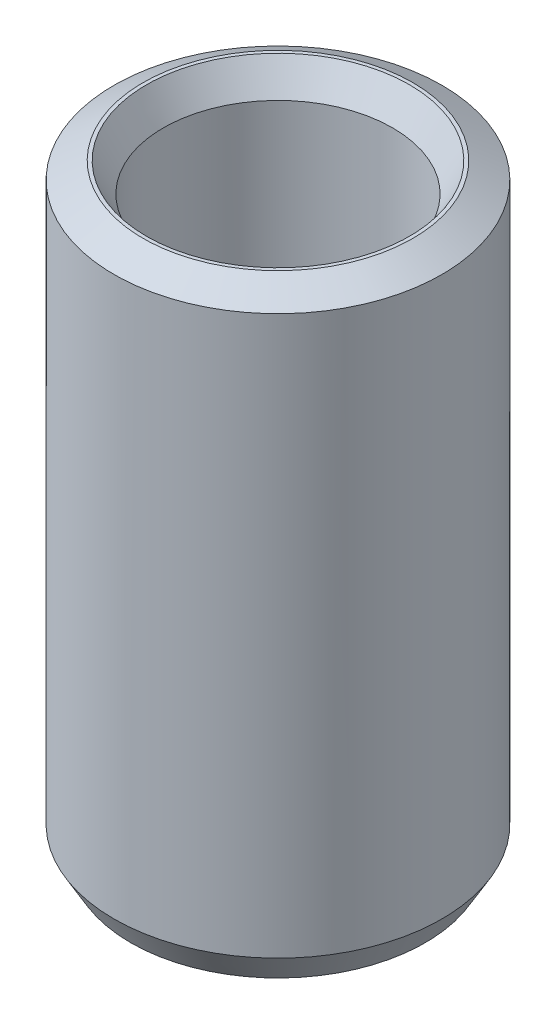
ISO-10303-21;
HEADER;
FILE_DESCRIPTION(('STEP AP214'),'2;1');
FILE_NAME('part.step','',(''),(''),'','','');
FILE_SCHEMA(('AUTOMOTIVE_DESIGN { 1 0 10303 214 1 1 1 1 }'));
ENDSEC;
DATA;
#1=APPLICATION_CONTEXT('core data for automotive mechanical design processes');
#2=APPLICATION_PROTOCOL_DEFINITION('international standard','automotive_design',2000,#1);
#3=PRODUCT_CONTEXT('',#1,'mechanical');
#4=PRODUCT('Part','Part','',(#3));
#5=PRODUCT_RELATED_PRODUCT_CATEGORY('part','',(#4));
#6=PRODUCT_DEFINITION_FORMATION('','',#4);
#7=PRODUCT_DEFINITION_CONTEXT('part definition',#1,'design');
#8=PRODUCT_DEFINITION('design','',#6,#7);
#9=PRODUCT_DEFINITION_SHAPE('','',#8);
#10=(LENGTH_UNIT() NAMED_UNIT(*) SI_UNIT(.MILLI.,.METRE.));
#11=(NAMED_UNIT(*) PLANE_ANGLE_UNIT() SI_UNIT($,.RADIAN.));
#12=(NAMED_UNIT(*) SI_UNIT($,.STERADIAN.) SOLID_ANGLE_UNIT());
#13=UNCERTAINTY_MEASURE_WITH_UNIT(LENGTH_MEASURE(1.E-05),#10,'distance_accuracy_value','');
#14=(GEOMETRIC_REPRESENTATION_CONTEXT(3) GLOBAL_UNCERTAINTY_ASSIGNED_CONTEXT((#13)) GLOBAL_UNIT_ASSIGNED_CONTEXT((#10,
#11,#12)) REPRESENTATION_CONTEXT('',''));
#15=CARTESIAN_POINT('',(0.,0.,0.));
#16=DIRECTION('',(0.,0.,1.));
#17=DIRECTION('',(1.,0.,0.));
#18=AXIS2_PLACEMENT_3D('',#15,#16,#17);
#19=CARTESIAN_POINT('',(0.,110.504376161559,0.));
#20=DIRECTION('',(0.,-1.,0.));
#21=DIRECTION('',(0.,0.,-1.));
#22=AXIS2_PLACEMENT_3D('',#19,#20,#21);
#23=CYLINDRICAL_SURFACE('',#22,30.);
#24=CARTESIAN_POINT('',(0.,5.31062044383036,0.));
#25=DIRECTION('',(0.,1.,0.));
#26=DIRECTION('',(0.,0.,1.));
#27=AXIS2_PLACEMENT_3D('',#24,#25,#26);
#28=CIRCLE('',#27,30.);
#29=CARTESIAN_POINT('',(0.,5.31062044383036,30.));
#30=VERTEX_POINT('',#29);
#31=EDGE_CURVE('E10',#30,#30,#28,.T.);
#32=ORIENTED_EDGE('',*,*,#31,.T.);
#33=EDGE_LOOP('',(#32));
#34=FACE_BOUND('',#33,.T.);
#35=CARTESIAN_POINT('',(0.,107.438288018749,0.));
#36=DIRECTION('',(0.,1.,0.));
#37=DIRECTION('',(0.,0.,1.));
#38=AXIS2_PLACEMENT_3D('',#35,#36,#37);
#39=CIRCLE('',#38,30.);
#40=CARTESIAN_POINT('',(0.,107.438288018749,-30.));
#41=VERTEX_POINT('',#40);
#42=EDGE_CURVE('E50',#41,#41,#39,.F.);
#43=ORIENTED_EDGE('',*,*,#42,.T.);
#44=EDGE_LOOP('',(#43));
#45=FACE_BOUND('',#44,.T.);
#46=ADVANCED_FACE('F39',(#34,#45),#23,.T.);
#47=CARTESIAN_POINT('',(0.,110.504376161559,0.));
#48=DIRECTION('',(0.,1.,0.));
#49=DIRECTION('',(0.,0.,1.));
#50=AXIS2_PLACEMENT_3D('',#47,#48,#49);
#51=PLANE('',#50);
#52=CARTESIAN_POINT('',(0.,110.504376161559,0.));
#53=DIRECTION('',(0.,1.,0.));
#54=DIRECTION('',(0.,0.,1.));
#55=AXIS2_PLACEMENT_3D('',#52,#53,#54);
#56=CIRCLE('',#55,24.0467735924519);
#57=CARTESIAN_POINT('',(0.,110.504376161559,24.0467735924519));
#58=VERTEX_POINT('',#57);
#59=EDGE_CURVE('E58',#58,#58,#56,.F.);
#60=ORIENTED_EDGE('',*,*,#59,.T.);
#61=EDGE_LOOP('',(#60));
#62=FACE_BOUND('',#61,.T.);
#63=CARTESIAN_POINT('',(0.,110.504376161559,0.));
#64=DIRECTION('',(0.,1.,0.));
#65=DIRECTION('',(0.,0.,1.));
#66=AXIS2_PLACEMENT_3D('',#63,#64,#65);
#67=CIRCLE('',#66,24.6893795561696);
#68=CARTESIAN_POINT('',(0.,110.504376161559,-24.6893795561697));
#69=VERTEX_POINT('',#68);
#70=EDGE_CURVE('E61',#69,#69,#67,.T.);
#71=ORIENTED_EDGE('',*,*,#70,.T.);
#72=EDGE_LOOP('',(#71));
#73=FACE_BOUND('',#72,.T.);
#74=ADVANCED_FACE('F88',(#62,#73),#51,.T.);
#75=CARTESIAN_POINT('',(0.,0.,0.));
#76=DIRECTION('',(0.,1.,0.));
#77=DIRECTION('',(0.,0.,1.));
#78=AXIS2_PLACEMENT_3D('',#75,#76,#77);
#79=PLANE('',#78);
#80=CARTESIAN_POINT('',(0.,0.,0.));
#81=DIRECTION('',(0.,1.,0.));
#82=DIRECTION('',(0.,0.,1.));
#83=AXIS2_PLACEMENT_3D('',#80,#81,#82);
#84=CIRCLE('',#83,26.2913058934728);
#85=CARTESIAN_POINT('',(0.,0.,-26.2913058934728));
#86=VERTEX_POINT('',#85);
#87=EDGE_CURVE('E51',#86,#86,#84,.T.);
#88=ORIENTED_EDGE('',*,*,#87,.T.);
#89=EDGE_LOOP('',(#88));
#90=FACE_BOUND('',#89,.T.);
#91=CARTESIAN_POINT('',(0.,0.,0.));
#92=DIRECTION('',(0.,1.,0.));
#93=DIRECTION('',(0.,0.,1.));
#94=AXIS2_PLACEMENT_3D('',#91,#92,#93);
#95=CIRCLE('',#94,26.9339118571906);
#96=CARTESIAN_POINT('',(0.,0.,26.9339118571906));
#97=VERTEX_POINT('',#96);
#98=EDGE_CURVE('E54',#97,#97,#95,.F.);
#99=ORIENTED_EDGE('',*,*,#98,.T.);
#100=EDGE_LOOP('',(#99));
#101=FACE_BOUND('',#100,.T.);
#102=ADVANCED_FACE('F83',(#90,#101),#79,.F.);
#103=CARTESIAN_POINT('',(0.,110.504376161559,0.));
#104=DIRECTION('',(0.,-1.,0.));
#105=DIRECTION('',(0.,0.,-1.));
#106=AXIS2_PLACEMENT_3D('',#103,#104,#105);
#107=CYLINDRICAL_SURFACE('',#106,20.9806854496425);
#108=CARTESIAN_POINT('',(0.,105.193755717728,0.));
#109=DIRECTION('',(0.,1.,0.));
#110=DIRECTION('',(0.,0.,1.));
#111=AXIS2_PLACEMENT_3D('',#108,#109,#110);
#112=CIRCLE('',#111,20.9806854496425);
#113=CARTESIAN_POINT('',(0.,105.193755717728,20.9806854496425));
#114=VERTEX_POINT('',#113);
#115=EDGE_CURVE('E67',#114,#114,#112,.T.);
#116=ORIENTED_EDGE('',*,*,#115,.T.);
#117=EDGE_LOOP('',(#116));
#118=FACE_BOUND('',#117,.T.);
#119=CARTESIAN_POINT('',(0.,3.0660881428094,0.));
#120=DIRECTION('',(0.,1.,0.));
#121=DIRECTION('',(0.,0.,1.));
#122=AXIS2_PLACEMENT_3D('',#119,#120,#121);
#123=CIRCLE('',#122,20.9806854496425);
#124=CARTESIAN_POINT('',(0.,3.0660881428094,-20.9806854496425));
#125=VERTEX_POINT('',#124);
#126=EDGE_CURVE('E69',#125,#125,#123,.F.);
#127=ORIENTED_EDGE('',*,*,#126,.T.);
#128=EDGE_LOOP('',(#127));
#129=FACE_BOUND('',#128,.T.);
#130=ADVANCED_FACE('F71',(#118,#129),#107,.F.);
#131=CARTESIAN_POINT('',(0.,105.193755717728,0.));
#132=DIRECTION('',(0.,1.,0.));
#133=DIRECTION('',(0.,0.,1.));
#134=AXIS2_PLACEMENT_3D('',#131,#132,#133);
#135=CONICAL_SURFACE('',#134,20.9806854496425,0.523598775598303);
#136=ORIENTED_EDGE('',*,*,#59,.F.);
#137=EDGE_LOOP('',(#136));
#138=FACE_BOUND('',#137,.T.);
#139=ORIENTED_EDGE('',*,*,#115,.F.);
#140=EDGE_LOOP('',(#139));
#141=FACE_BOUND('',#140,.T.);
#142=ADVANCED_FACE('F77',(#138,#141),#135,.F.);
#143=CARTESIAN_POINT('',(0.,0.,0.));
#144=DIRECTION('',(0.,-1.,0.));
#145=DIRECTION('',(0.,0.,-1.));
#146=AXIS2_PLACEMENT_3D('',#143,#144,#145);
#147=CONICAL_SURFACE('',#146,26.2913058934728,1.0471975511966);
#148=CARTESIAN_POINT('',(0.,3.0660881428094,-20.9806854496425));
#149=CARTESIAN_POINT('',(0.,3.03414972465513,-21.036004412599));
#150=CARTESIAN_POINT('',(0.,3.00221130650087,-21.0913233755556));
#151=CARTESIAN_POINT('',(0.,2.93833447019234,-21.2019613014687));
#152=CARTESIAN_POINT('',(0.,2.90639605203807,-21.2572802644253));
#153=CARTESIAN_POINT('',(0.,2.84251921572955,-21.3679181903384));
#154=CARTESIAN_POINT('',(0.,2.81058079757528,-21.423237153295));
#155=CARTESIAN_POINT('',(0.,2.74670396126675,-21.5338750792081));
#156=CARTESIAN_POINT('',(0.,2.71476554311249,-21.5891940421647));
#157=CARTESIAN_POINT('',(0.,2.65088870680396,-21.6998319680778));
#158=CARTESIAN_POINT('',(0.,2.61895028864969,-21.7551509310344));
#159=CARTESIAN_POINT('',(0.,2.55507345234116,-21.8657888569475));
#160=CARTESIAN_POINT('',(0.,2.5231350341869,-21.9211078199041));
#161=CARTESIAN_POINT('',(0.,2.45925819787837,-22.0317457458172));
#162=CARTESIAN_POINT('',(0.,2.42731977972411,-22.0870647087738));
#163=CARTESIAN_POINT('',(0.,2.36344294341558,-22.1977026346869));
#164=CARTESIAN_POINT('',(0.,2.33150452526131,-22.2530215976435));
#165=CARTESIAN_POINT('',(0.,2.26762768895278,-22.3636595235566));
#166=CARTESIAN_POINT('',(0.,2.23568927079852,-22.4189784865132));
#167=CARTESIAN_POINT('',(0.,2.17181243448999,-22.5296164124263));
#168=CARTESIAN_POINT('',(0.,2.13987401633573,-22.5849353753829));
#169=CARTESIAN_POINT('',(0.,2.0759971800272,-22.695573301296));
#170=CARTESIAN_POINT('',(0.,2.04405876187293,-22.7508922642526));
#171=CARTESIAN_POINT('',(0.,1.9801819255644,-22.8615301901657));
#172=CARTESIAN_POINT('',(0.,1.94824350741014,-22.9168491531223));
#173=CARTESIAN_POINT('',(0.,1.88436667110161,-23.0274870790354));
#174=CARTESIAN_POINT('',(0.,1.85242825294734,-23.082806041992));
#175=CARTESIAN_POINT('',(0.,1.78855141663882,-23.1934439679051));
#176=CARTESIAN_POINT('',(0.,1.75661299848455,-23.2487629308617));
#177=CARTESIAN_POINT('',(0.,1.69273616217602,-23.3594008567748));
#178=CARTESIAN_POINT('',(0.,1.66079774402176,-23.4147198197314));
#179=CARTESIAN_POINT('',(0.,1.59692090771323,-23.5253577456445));
#180=CARTESIAN_POINT('',(0.,1.56498248955896,-23.5806767086011));
#181=CARTESIAN_POINT('',(0.,1.50110565325043,-23.6913146345142));
#182=CARTESIAN_POINT('',(0.,1.46916723509617,-23.7466335974708));
#183=CARTESIAN_POINT('',(0.,1.40529039878764,-23.8572715233839));
#184=CARTESIAN_POINT('',(0.,1.37335198063338,-23.9125904863405));
#185=CARTESIAN_POINT('',(0.,1.30947514432485,-24.0232284122536));
#186=CARTESIAN_POINT('',(0.,1.27753672617058,-24.0785473752102));
#187=CARTESIAN_POINT('',(0.,1.21365988986205,-24.1891853011233));
#188=CARTESIAN_POINT('',(0.,1.18172147170779,-24.2445042640799));
#189=CARTESIAN_POINT('',(0.,1.11784463539926,-24.355142189993));
#190=CARTESIAN_POINT('',(0.,1.08590621724499,-24.4104611529496));
#191=CARTESIAN_POINT('',(0.,1.02202938093647,-24.5210990788627));
#192=CARTESIAN_POINT('',(0.,0.990090962782201,-24.5764180418193));
#193=CARTESIAN_POINT('',(0.,0.926214126473672,-24.6870559677324));
#194=CARTESIAN_POINT('',(0.,0.894275708319407,-24.742374930689));
#195=CARTESIAN_POINT('',(0.,0.830398872010878,-24.8530128566021));
#196=CARTESIAN_POINT('',(0.,0.798460453856614,-24.9083318195587));
#197=CARTESIAN_POINT('',(0.,0.734583617548085,-25.0189697454718));
#198=CARTESIAN_POINT('',(0.,0.70264519939382,-25.0742887084284));
#199=CARTESIAN_POINT('',(0.,0.638768363085291,-25.1849266343415));
#200=CARTESIAN_POINT('',(0.,0.606829944931026,-25.2402455972981));
#201=CARTESIAN_POINT('',(0.,0.542953108622497,-25.3508835232112));
#202=CARTESIAN_POINT('',(0.,0.511014690468233,-25.4062024861678));
#203=CARTESIAN_POINT('',(0.,0.447137854159704,-25.5168404120809));
#204=CARTESIAN_POINT('',(0.,0.415199436005439,-25.5721593750375));
#205=CARTESIAN_POINT('',(0.,0.35132259969691,-25.6827973009506));
#206=CARTESIAN_POINT('',(0.,0.319384181542646,-25.7381162639072));
#207=CARTESIAN_POINT('',(0.,0.255507345234116,-25.8487541898203));
#208=CARTESIAN_POINT('',(0.,0.223568927079852,-25.9040731527769));
#209=CARTESIAN_POINT('',(0.,0.159692090771323,-26.01471107869));
#210=CARTESIAN_POINT('',(0.,0.127753672617058,-26.0700300416466));
#211=CARTESIAN_POINT('',(0.,0.0638768363085291,-26.1806679675597));
#212=CARTESIAN_POINT('',(0.,0.0319384181542646,-26.2359869305163));
#213=CARTESIAN_POINT('',(0.,0.,-26.2913058934728));
#214=B_SPLINE_CURVE_WITH_KNOTS('',3,(#148,#149,#150,#151,#152,#153,#154,#155,#156,#157,#158,
#159,#160,#161,#162,#163,#164,#165,#166,#167,#168,#169,#170,#171,#172,#173,#174,#175,#176,#177,
#178,#179,#180,#181,#182,#183,#184,#185,#186,#187,#188,#189,#190,#191,#192,#193,#194,#195,#196,
#197,#198,#199,#200,#201,#202,#203,#204,#205,#206,#207,#208,#209,#210,#211,#212,#213),
.UNSPECIFIED.,.F.,.F.,(4,2,2,2,2,2,2,2,2,2,2,2,2,2,2,2,2,2,2,2,2,2,2,2,2,2,2,2,2,2,2,2,4),(0.,
0.191630508925587,0.383261017851173,0.57489152677676,0.766522035702347,0.958152544627933,
1.14978305355352,1.34141356247911,1.53304407140469,1.72467458033028,1.91630508925587,
2.10793559818146,2.29956610710704,2.49119661603263,2.68282712495822,2.8744576338838,
3.06608814280939,3.25771865173497,3.44934916066056,3.64097966958615,3.83261017851173,
4.02424068743732,4.21587119636291,4.40750170528849,4.59913221421408,4.79076272313967,
4.98239323206526,5.17402374099084,5.36565424991643,5.55728475884202,5.7489152677676,
5.94054577669319,6.13217628561878),.UNSPECIFIED.);
#215=EDGE_CURVE('BSEAM73',#125,#86,#214,.T.);
#216=ORIENTED_EDGE('',*,*,#126,.F.);
#217=ORIENTED_EDGE('',*,*,#87,.F.);
#218=ORIENTED_EDGE('',*,*,#215,.T.);
#219=ORIENTED_EDGE('',*,*,#215,.F.);
#220=EDGE_LOOP('',(#216,#218,#217,#219));
#221=FACE_BOUND('',#220,.T.);
#222=ADVANCED_FACE('F73',(#221),#147,.F.);
#223=CARTESIAN_POINT('',(0.,5.31062044383036,0.));
#224=DIRECTION('',(0.,1.,0.));
#225=DIRECTION('',(0.,0.,1.));
#226=AXIS2_PLACEMENT_3D('',#223,#224,#225);
#227=CONICAL_SURFACE('',#226,30.,0.523598775598303);
#228=ORIENTED_EDGE('',*,*,#98,.F.);
#229=EDGE_LOOP('',(#228));
#230=FACE_BOUND('',#229,.T.);
#231=ORIENTED_EDGE('',*,*,#31,.F.);
#232=EDGE_LOOP('',(#231));
#233=FACE_BOUND('',#232,.T.);
#234=ADVANCED_FACE('F76',(#230,#233),#227,.T.);
#235=CARTESIAN_POINT('',(0.,110.504376161559,0.));
#236=DIRECTION('',(0.,-1.,0.));
#237=DIRECTION('',(0.,0.,-1.));
#238=AXIS2_PLACEMENT_3D('',#235,#236,#237);
#239=CONICAL_SURFACE('',#238,24.6893795561696,1.0471975511966);
#240=CARTESIAN_POINT('',(0.,107.438288018749,-30.));
#241=CARTESIAN_POINT('',(0.,107.470226436904,-29.9446810370434));
#242=CARTESIAN_POINT('',(0.,107.502164855058,-29.8893620740869));
#243=CARTESIAN_POINT('',(0.,107.566041691366,-29.7787241481737));
#244=CARTESIAN_POINT('',(0.,107.597980109521,-29.7234051852172));
#245=CARTESIAN_POINT('',(0.,107.661856945829,-29.6127672593041));
#246=CARTESIAN_POINT('',(0.,107.693795363983,-29.5574482963475));
#247=CARTESIAN_POINT('',(0.,107.757672200292,-29.4468103704343));
#248=CARTESIAN_POINT('',(0.,107.789610618446,-29.3914914074778));
#249=CARTESIAN_POINT('',(0.,107.853487454755,-29.2808534815647));
#250=CARTESIAN_POINT('',(0.,107.885425872909,-29.2255345186081));
#251=CARTESIAN_POINT('',(0.,107.949302709218,-29.114896592695));
#252=CARTESIAN_POINT('',(0.,107.981241127372,-29.0595776297384));
#253=CARTESIAN_POINT('',(0.,108.04511796368,-28.9489397038253));
#254=CARTESIAN_POINT('',(0.,108.077056381835,-28.8936207408687));
#255=CARTESIAN_POINT('',(0.,108.140933218143,-28.7829828149556));
#256=CARTESIAN_POINT('',(0.,108.172871636297,-28.727663851999));
#257=CARTESIAN_POINT('',(0.,108.236748472606,-28.6170259260859));
#258=CARTESIAN_POINT('',(0.,108.26868689076,-28.5617069631293));
#259=CARTESIAN_POINT('',(0.,108.332563727069,-28.4510690372162));
#260=CARTESIAN_POINT('',(0.,108.364502145223,-28.3957500742596));
#261=CARTESIAN_POINT('',(0.,108.428378981532,-28.2851121483465));
#262=CARTESIAN_POINT('',(0.,108.460317399686,-28.2297931853899));
#263=CARTESIAN_POINT('',(0.,108.524194235994,-28.1191552594768));
#264=CARTESIAN_POINT('',(0.,108.556132654149,-28.0638362965202));
#265=CARTESIAN_POINT('',(0.,108.620009490457,-27.9531983706071));
#266=CARTESIAN_POINT('',(0.,108.651947908611,-27.8978794076505));
#267=CARTESIAN_POINT('',(0.,108.71582474492,-27.7872414817374));
#268=CARTESIAN_POINT('',(0.,108.747763163074,-27.7319225187808));
#269=CARTESIAN_POINT('',(0.,108.811639999383,-27.6212845928677));
#270=CARTESIAN_POINT('',(0.,108.843578417537,-27.5659656299111));
#271=CARTESIAN_POINT('',(0.,108.907455253846,-27.455327703998));
#272=CARTESIAN_POINT('',(0.,108.939393672,-27.4000087410414));
#273=CARTESIAN_POINT('',(0.,109.003270508308,-27.2893708151283));
#274=CARTESIAN_POINT('',(0.,109.035208926463,-27.2340518521717));
#275=CARTESIAN_POINT('',(0.,109.099085762771,-27.1234139262586));
#276=CARTESIAN_POINT('',(0.,109.131024180925,-27.068094963302));
#277=CARTESIAN_POINT('',(0.,109.194901017234,-26.9574570373889));
#278=CARTESIAN_POINT('',(0.,109.226839435388,-26.9021380744323));
#279=CARTESIAN_POINT('',(0.,109.290716271697,-26.7915001485192));
#280=CARTESIAN_POINT('',(0.,109.322654689851,-26.7361811855626));
#281=CARTESIAN_POINT('',(0.,109.386531526159,-26.6255432596495));
#282=CARTESIAN_POINT('',(0.,109.418469944314,-26.5702242966929));
#283=CARTESIAN_POINT('',(0.,109.482346780622,-26.4595863707798));
#284=CARTESIAN_POINT('',(0.,109.514285198777,-26.4042674078232));
#285=CARTESIAN_POINT('',(0.,109.578162035085,-26.2936294819101));
#286=CARTESIAN_POINT('',(0.,109.610100453239,-26.2383105189535));
#287=CARTESIAN_POINT('',(0.,109.673977289548,-26.1276725930404));
#288=CARTESIAN_POINT('',(0.,109.705915707702,-26.0723536300838));
#289=CARTESIAN_POINT('',(0.,109.769792544011,-25.9617157041707));
#290=CARTESIAN_POINT('',(0.,109.801730962165,-25.9063967412141));
#291=CARTESIAN_POINT('',(0.,109.865607798473,-25.795758815301));
#292=CARTESIAN_POINT('',(0.,109.897546216628,-25.7404398523444));
#293=CARTESIAN_POINT('',(0.,109.961423052936,-25.6298019264313));
#294=CARTESIAN_POINT('',(0.,109.99336147109,-25.5744829634747));
#295=CARTESIAN_POINT('',(0.,110.057238307399,-25.4638450375616));
#296=CARTESIAN_POINT('',(0.,110.089176725553,-25.408526074605));
#297=CARTESIAN_POINT('',(0.,110.153053561862,-25.2978881486919));
#298=CARTESIAN_POINT('',(0.,110.184991980016,-25.2425691857353));
#299=CARTESIAN_POINT('',(0.,110.248868816325,-25.1319312598222));
#300=CARTESIAN_POINT('',(0.,110.280807234479,-25.0766122968656));
#301=CARTESIAN_POINT('',(0.,110.344684070787,-24.9659743709525));
#302=CARTESIAN_POINT('',(0.,110.376622488942,-24.9106554079959));
#303=CARTESIAN_POINT('',(0.,110.44049932525,-24.8000174820828));
#304=CARTESIAN_POINT('',(0.,110.472437743404,-24.7446985191262));
#305=CARTESIAN_POINT('',(0.,110.504376161559,-24.6893795561697));
#306=B_SPLINE_CURVE_WITH_KNOTS('',3,(#240,#241,#242,#243,#244,#245,#246,#247,#248,#249,#250,
#251,#252,#253,#254,#255,#256,#257,#258,#259,#260,#261,#262,#263,#264,#265,#266,#267,#268,#269,
#270,#271,#272,#273,#274,#275,#276,#277,#278,#279,#280,#281,#282,#283,#284,#285,#286,#287,#288,
#289,#290,#291,#292,#293,#294,#295,#296,#297,#298,#299,#300,#301,#302,#303,#304,#305),
.UNSPECIFIED.,.F.,.F.,(4,2,2,2,2,2,2,2,2,2,2,2,2,2,2,2,2,2,2,2,2,2,2,2,2,2,2,2,2,2,2,2,4),(0.,
0.191630508925584,0.38326101785117,0.574891526776761,0.766522035702347,0.958152544627931,
1.14978305355352,1.34141356247911,1.53304407140469,1.72467458033028,1.91630508925586,
2.10793559818145,2.29956610710704,2.49119661603262,2.68282712495821,2.8744576338838,
3.06608814280939,3.25771865173497,3.44934916066056,3.64097966958615,3.83261017851173,
4.02424068743732,4.2158711963629,4.40750170528849,4.59913221421408,4.79076272313966,
4.98239323206525,5.17402374099084,5.36565424991643,5.55728475884201,5.7489152677676,
5.94054577669319,6.13217628561878),.UNSPECIFIED.);
#307=EDGE_CURVE('BSEAM45',#41,#69,#306,.T.);
#308=ORIENTED_EDGE('',*,*,#42,.F.);
#309=ORIENTED_EDGE('',*,*,#70,.F.);
#310=ORIENTED_EDGE('',*,*,#307,.T.);
#311=ORIENTED_EDGE('',*,*,#307,.F.);
#312=EDGE_LOOP('',(#308,#310,#309,#311));
#313=FACE_BOUND('',#312,.T.);
#314=ADVANCED_FACE('F45',(#313),#239,.T.);
#315=CLOSED_SHELL('',(#46,#74,#102,#130,#142,#222,#234,#314));
#316=MANIFOLD_SOLID_BREP('B2',#315);
#317=ADVANCED_BREP_SHAPE_REPRESENTATION('',(#18,#316),#14);
#318=SHAPE_DEFINITION_REPRESENTATION(#9,#317);
ENDSEC;
END-ISO-10303-21;
